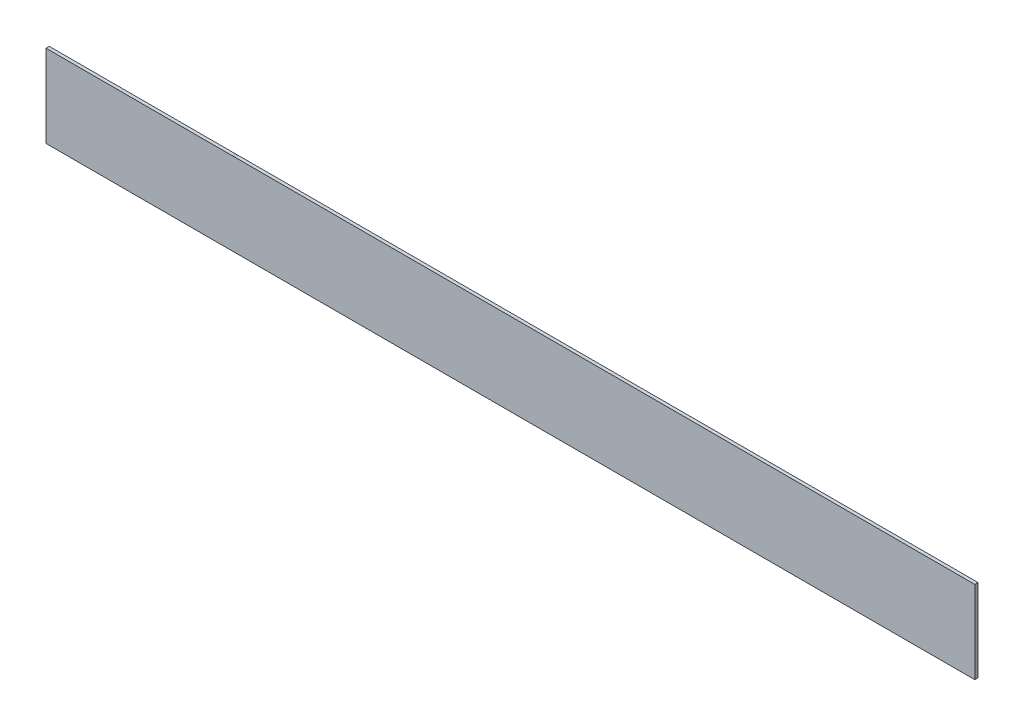
ISO-10303-21;
HEADER;
FILE_DESCRIPTION(('STEP AP214'),'2;1');
FILE_NAME('part.step','',(''),(''),'','','');
FILE_SCHEMA(('AUTOMOTIVE_DESIGN { 1 0 10303 214 1 1 1 1 }'));
ENDSEC;
DATA;
#1=APPLICATION_CONTEXT('core data for automotive mechanical design processes');
#2=APPLICATION_PROTOCOL_DEFINITION('international standard','automotive_design',2000,#1);
#3=PRODUCT_CONTEXT('',#1,'mechanical');
#4=PRODUCT('Part','Part','',(#3));
#5=PRODUCT_RELATED_PRODUCT_CATEGORY('part','',(#4));
#6=PRODUCT_DEFINITION_FORMATION('','',#4);
#7=PRODUCT_DEFINITION_CONTEXT('part definition',#1,'design');
#8=PRODUCT_DEFINITION('design','',#6,#7);
#9=PRODUCT_DEFINITION_SHAPE('','',#8);
#10=(LENGTH_UNIT() NAMED_UNIT(*) SI_UNIT(.MILLI.,.METRE.));
#11=(NAMED_UNIT(*) PLANE_ANGLE_UNIT() SI_UNIT($,.RADIAN.));
#12=(NAMED_UNIT(*) SI_UNIT($,.STERADIAN.) SOLID_ANGLE_UNIT());
#13=UNCERTAINTY_MEASURE_WITH_UNIT(LENGTH_MEASURE(1.E-05),#10,'distance_accuracy_value','');
#14=(GEOMETRIC_REPRESENTATION_CONTEXT(3) GLOBAL_UNCERTAINTY_ASSIGNED_CONTEXT((#13)) GLOBAL_UNIT_ASSIGNED_CONTEXT((#10,
#11,#12)) REPRESENTATION_CONTEXT('',''));
#15=CARTESIAN_POINT('',(0.,0.,0.));
#16=DIRECTION('',(0.,0.,1.));
#17=DIRECTION('',(1.,0.,0.));
#18=AXIS2_PLACEMENT_3D('',#15,#16,#17);
#19=CARTESIAN_POINT('',(0.,0.,0.05));
#20=DIRECTION('',(0.,0.,1.));
#21=DIRECTION('',(1.,0.,0.));
#22=AXIS2_PLACEMENT_3D('',#19,#20,#21);
#23=PLANE('',#22);
#24=DIRECTION('',(-0.999763788823916,-0.0217339954092104,0.));
#25=VECTOR('',#24,1.);
#26=CARTESIAN_POINT('',(2.794762,1.126998,0.05));
#27=LINE('',#26,#25);
#28=CARTESIAN_POINT('',(2.794762,1.126998,0.05));
#29=VERTEX_POINT('',#28);
#30=CARTESIAN_POINT('',(2.75971,1.126236,0.05));
#31=VERTEX_POINT('',#30);
#32=EDGE_CURVE('E11',#29,#31,#27,.T.);
#33=ORIENTED_EDGE('',*,*,#32,.T.);
#34=DIRECTION('',(-1.,0.,0.));
#35=VECTOR('',#34,1.);
#36=CARTESIAN_POINT('',(2.75971,1.126236,0.05));
#37=LINE('',#36,#35);
#38=CARTESIAN_POINT('',(-0.109728,1.126236,0.05));
#39=VERTEX_POINT('',#38);
#40=EDGE_CURVE('E124',#31,#39,#37,.T.);
#41=ORIENTED_EDGE('',*,*,#40,.T.);
#42=DIRECTION('',(0.,-1.,0.));
#43=VECTOR('',#42,1.);
#44=CARTESIAN_POINT('',(-0.109728,1.126236,0.05));
#45=LINE('',#44,#43);
#46=CARTESIAN_POINT('',(-0.109728,-0.143764,0.05));
#47=VERTEX_POINT('',#46);
#48=EDGE_CURVE('E116',#39,#47,#45,.T.);
#49=ORIENTED_EDGE('',*,*,#48,.T.);
#50=DIRECTION('',(1.,0.,0.));
#51=VECTOR('',#50,1.);
#52=CARTESIAN_POINT('',(-0.109728,-0.143764,0.05));
#53=LINE('',#52,#51);
#54=CARTESIAN_POINT('',(14.186916,-0.143764,0.05));
#55=VERTEX_POINT('',#54);
#56=EDGE_CURVE('E83',#47,#55,#53,.T.);
#57=ORIENTED_EDGE('',*,*,#56,.T.);
#58=DIRECTION('',(0.,1.,0.));
#59=VECTOR('',#58,1.);
#60=CARTESIAN_POINT('',(14.186916,-0.143764,0.05));
#61=LINE('',#60,#59);
#62=CARTESIAN_POINT('',(14.186916,1.126744,0.05));
#63=VERTEX_POINT('',#62);
#64=EDGE_CURVE('E76',#55,#63,#61,.T.);
#65=ORIENTED_EDGE('',*,*,#64,.T.);
#66=DIRECTION('',(-0.999999999751443,2.2296046905341E-05,0.));
#67=VECTOR('',#66,1.);
#68=CARTESIAN_POINT('',(14.186916,1.126744,0.05));
#69=LINE('',#68,#67);
#70=EDGE_CURVE('E79',#63,#29,#69,.T.);
#71=ORIENTED_EDGE('',*,*,#70,.T.);
#72=EDGE_LOOP('',(#33,#41,#49,#57,#65,#71));
#73=FACE_BOUND('',#72,.T.);
#74=ADVANCED_FACE('F17',(#73),#23,.T.);
#75=CARTESIAN_POINT('',(2.794762,1.126998,0.));
#76=DIRECTION('',(-0.0217339954092104,0.999763788823916,0.));
#77=DIRECTION('',(0.,0.,1.));
#78=AXIS2_PLACEMENT_3D('',#75,#76,#77);
#79=PLANE('',#78);
#80=DIRECTION('',(0.,0.,1.));
#81=VECTOR('',#80,1.);
#82=CARTESIAN_POINT('',(2.75971,1.126236,0.));
#83=LINE('',#82,#81);
#84=CARTESIAN_POINT('',(2.75971,1.126236,0.));
#85=VERTEX_POINT('',#84);
#86=EDGE_CURVE('E28',#85,#31,#83,.T.);
#87=ORIENTED_EDGE('',*,*,#86,.T.);
#88=ORIENTED_EDGE('',*,*,#32,.F.);
#89=DIRECTION('',(0.,0.,1.));
#90=VECTOR('',#89,1.);
#91=CARTESIAN_POINT('',(2.794762,1.126998,0.));
#92=LINE('',#91,#90);
#93=CARTESIAN_POINT('',(2.794762,1.126998,0.));
#94=VERTEX_POINT('',#93);
#95=EDGE_CURVE('E98',#94,#29,#92,.T.);
#96=ORIENTED_EDGE('',*,*,#95,.F.);
#97=DIRECTION('',(-0.999763788823916,-0.0217339954092104,0.));
#98=VECTOR('',#97,1.);
#99=CARTESIAN_POINT('',(2.794762,1.126998,0.));
#100=LINE('',#99,#98);
#101=EDGE_CURVE('E111',#94,#85,#100,.T.);
#102=ORIENTED_EDGE('',*,*,#101,.T.);
#103=EDGE_LOOP('',(#87,#88,#96,#102));
#104=FACE_BOUND('',#103,.T.);
#105=ADVANCED_FACE('F292',(#104),#79,.T.);
#106=CARTESIAN_POINT('',(2.75971,1.126236,0.));
#107=DIRECTION('',(0.,1.,0.));
#108=DIRECTION('',(1.,0.,0.));
#109=AXIS2_PLACEMENT_3D('',#106,#107,#108);
#110=PLANE('',#109);
#111=DIRECTION('',(0.,0.,1.));
#112=VECTOR('',#111,1.);
#113=CARTESIAN_POINT('',(-0.109728,1.126236,0.));
#114=LINE('',#113,#112);
#115=CARTESIAN_POINT('',(-0.109728,1.126236,0.));
#116=VERTEX_POINT('',#115);
#117=EDGE_CURVE('E119',#116,#39,#114,.T.);
#118=ORIENTED_EDGE('',*,*,#117,.T.);
#119=ORIENTED_EDGE('',*,*,#40,.F.);
#120=ORIENTED_EDGE('',*,*,#86,.F.);
#121=DIRECTION('',(-1.,0.,0.));
#122=VECTOR('',#121,1.);
#123=CARTESIAN_POINT('',(2.75971,1.126236,0.));
#124=LINE('',#123,#122);
#125=EDGE_CURVE('E135',#85,#116,#124,.T.);
#126=ORIENTED_EDGE('',*,*,#125,.T.);
#127=EDGE_LOOP('',(#118,#119,#120,#126));
#128=FACE_BOUND('',#127,.T.);
#129=ADVANCED_FACE('F304',(#128),#110,.T.);
#130=CARTESIAN_POINT('',(-0.109728,1.126236,0.));
#131=DIRECTION('',(-1.,0.,0.));
#132=DIRECTION('',(0.,0.,1.));
#133=AXIS2_PLACEMENT_3D('',#130,#131,#132);
#134=PLANE('',#133);
#135=DIRECTION('',(0.,0.,1.));
#136=VECTOR('',#135,1.);
#137=CARTESIAN_POINT('',(-0.109728,-0.143764,0.));
#138=LINE('',#137,#136);
#139=CARTESIAN_POINT('',(-0.109728,-0.143764,0.));
#140=VERTEX_POINT('',#139);
#141=EDGE_CURVE('E120',#140,#47,#138,.T.);
#142=ORIENTED_EDGE('',*,*,#141,.T.);
#143=ORIENTED_EDGE('',*,*,#48,.F.);
#144=ORIENTED_EDGE('',*,*,#117,.F.);
#145=DIRECTION('',(0.,-1.,0.));
#146=VECTOR('',#145,1.);
#147=CARTESIAN_POINT('',(-0.109728,1.126236,0.));
#148=LINE('',#147,#146);
#149=EDGE_CURVE('E115',#116,#140,#148,.T.);
#150=ORIENTED_EDGE('',*,*,#149,.T.);
#151=EDGE_LOOP('',(#142,#143,#144,#150));
#152=FACE_BOUND('',#151,.T.);
#153=ADVANCED_FACE('F314',(#152),#134,.T.);
#154=CARTESIAN_POINT('',(-0.109728,-0.143764,0.));
#155=DIRECTION('',(0.,-1.,0.));
#156=DIRECTION('',(0.,0.,-1.));
#157=AXIS2_PLACEMENT_3D('',#154,#155,#156);
#158=PLANE('',#157);
#159=DIRECTION('',(0.,0.,1.));
#160=VECTOR('',#159,1.);
#161=CARTESIAN_POINT('',(14.186916,-0.143764,0.));
#162=LINE('',#161,#160);
#163=CARTESIAN_POINT('',(14.186916,-0.143764,0.));
#164=VERTEX_POINT('',#163);
#165=EDGE_CURVE('E87',#164,#55,#162,.T.);
#166=ORIENTED_EDGE('',*,*,#165,.T.);
#167=ORIENTED_EDGE('',*,*,#56,.F.);
#168=ORIENTED_EDGE('',*,*,#141,.F.);
#169=DIRECTION('',(1.,0.,0.));
#170=VECTOR('',#169,1.);
#171=CARTESIAN_POINT('',(-0.109728,-0.143764,0.));
#172=LINE('',#171,#170);
#173=EDGE_CURVE('E112',#140,#164,#172,.T.);
#174=ORIENTED_EDGE('',*,*,#173,.T.);
#175=EDGE_LOOP('',(#166,#167,#168,#174));
#176=FACE_BOUND('',#175,.T.);
#177=ADVANCED_FACE('F147',(#176),#158,.T.);
#178=CARTESIAN_POINT('',(14.186916,-0.143764,0.));
#179=DIRECTION('',(1.,0.,0.));
#180=DIRECTION('',(0.,1.,0.));
#181=AXIS2_PLACEMENT_3D('',#178,#179,#180);
#182=PLANE('',#181);
#183=DIRECTION('',(0.,0.,1.));
#184=VECTOR('',#183,1.);
#185=CARTESIAN_POINT('',(14.186916,1.126744,0.));
#186=LINE('',#185,#184);
#187=CARTESIAN_POINT('',(14.186916,1.126744,0.));
#188=VERTEX_POINT('',#187);
#189=EDGE_CURVE('E88',#188,#63,#186,.T.);
#190=ORIENTED_EDGE('',*,*,#189,.T.);
#191=ORIENTED_EDGE('',*,*,#64,.F.);
#192=ORIENTED_EDGE('',*,*,#165,.F.);
#193=DIRECTION('',(0.,1.,0.));
#194=VECTOR('',#193,1.);
#195=CARTESIAN_POINT('',(14.186916,-0.143764,0.));
#196=LINE('',#195,#194);
#197=EDGE_CURVE('E21',#164,#188,#196,.T.);
#198=ORIENTED_EDGE('',*,*,#197,.T.);
#199=EDGE_LOOP('',(#190,#191,#192,#198));
#200=FACE_BOUND('',#199,.T.);
#201=ADVANCED_FACE('F90',(#200),#182,.T.);
#202=CARTESIAN_POINT('',(14.186916,1.126744,0.));
#203=DIRECTION('',(2.2296046905341E-05,0.999999999751443,0.));
#204=DIRECTION('',(0.,0.,-1.));
#205=AXIS2_PLACEMENT_3D('',#202,#203,#204);
#206=PLANE('',#205);
#207=ORIENTED_EDGE('',*,*,#95,.T.);
#208=ORIENTED_EDGE('',*,*,#70,.F.);
#209=ORIENTED_EDGE('',*,*,#189,.F.);
#210=DIRECTION('',(-0.999999999751443,2.2296046905341E-05,0.));
#211=VECTOR('',#210,1.);
#212=CARTESIAN_POINT('',(14.186916,1.126744,0.));
#213=LINE('',#212,#211);
#214=EDGE_CURVE('E107',#188,#94,#213,.T.);
#215=ORIENTED_EDGE('',*,*,#214,.T.);
#216=EDGE_LOOP('',(#207,#208,#209,#215));
#217=FACE_BOUND('',#216,.T.);
#218=ADVANCED_FACE('F19',(#217),#206,.T.);
#219=CARTESIAN_POINT('',(0.,0.,0.));
#220=DIRECTION('',(0.,0.,1.));
#221=DIRECTION('',(1.,0.,0.));
#222=AXIS2_PLACEMENT_3D('',#219,#220,#221);
#223=PLANE('',#222);
#224=ORIENTED_EDGE('',*,*,#197,.F.);
#225=ORIENTED_EDGE('',*,*,#173,.F.);
#226=ORIENTED_EDGE('',*,*,#149,.F.);
#227=ORIENTED_EDGE('',*,*,#125,.F.);
#228=ORIENTED_EDGE('',*,*,#101,.F.);
#229=ORIENTED_EDGE('',*,*,#214,.F.);
#230=EDGE_LOOP('',(#224,#225,#226,#227,#228,#229));
#231=FACE_BOUND('',#230,.T.);
#232=ADVANCED_FACE('F151',(#231),#223,.F.);
#233=CLOSED_SHELL('',(#74,#105,#129,#153,#177,#201,#218,#232));
#234=MANIFOLD_SOLID_BREP('B1',#233);
#235=ADVANCED_BREP_SHAPE_REPRESENTATION('',(#18,#234),#14);
#236=SHAPE_DEFINITION_REPRESENTATION(#9,#235);
ENDSEC;
END-ISO-10303-21;
